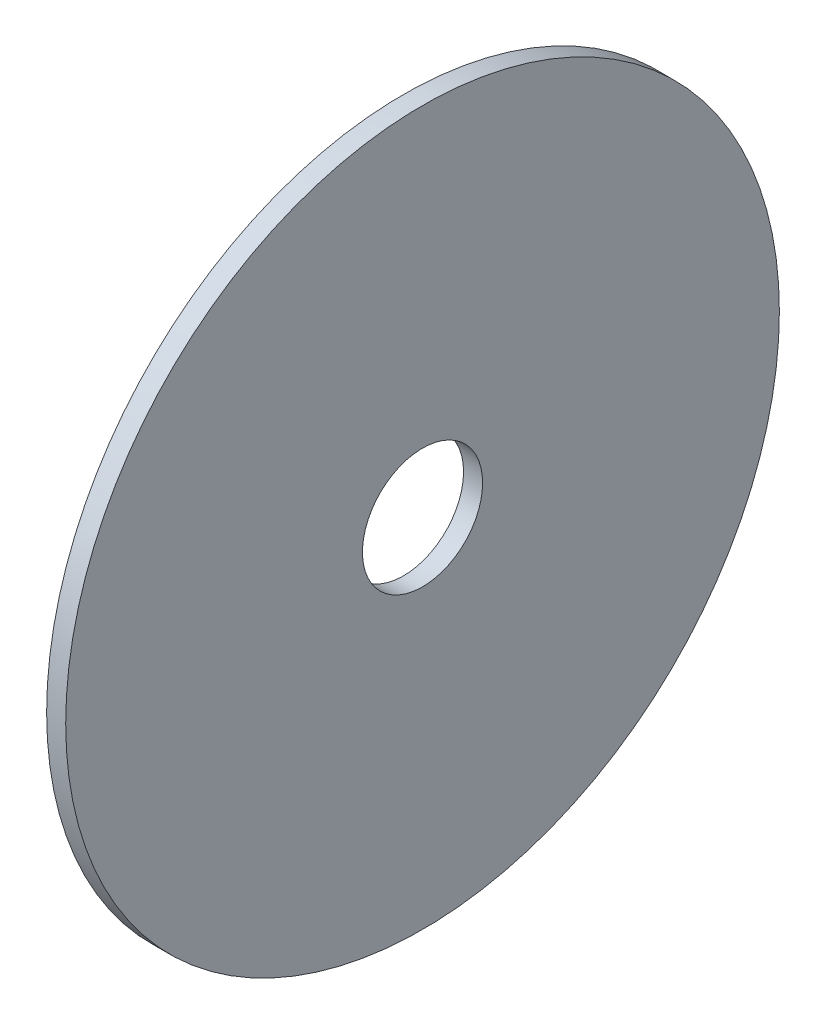
ISO-10303-21;
HEADER;
FILE_DESCRIPTION(('STEP AP214'),'2;1');
FILE_NAME('part.step','',(''),(''),'','','');
FILE_SCHEMA(('AUTOMOTIVE_DESIGN { 1 0 10303 214 1 1 1 1 }'));
ENDSEC;
DATA;
#1=APPLICATION_CONTEXT('core data for automotive mechanical design processes');
#2=APPLICATION_PROTOCOL_DEFINITION('international standard','automotive_design',2000,#1);
#3=PRODUCT_CONTEXT('',#1,'mechanical');
#4=PRODUCT('Part','Part','',(#3));
#5=PRODUCT_RELATED_PRODUCT_CATEGORY('part','',(#4));
#6=PRODUCT_DEFINITION_FORMATION('','',#4);
#7=PRODUCT_DEFINITION_CONTEXT('part definition',#1,'design');
#8=PRODUCT_DEFINITION('design','',#6,#7);
#9=PRODUCT_DEFINITION_SHAPE('','',#8);
#10=(LENGTH_UNIT() NAMED_UNIT(*) SI_UNIT(.MILLI.,.METRE.));
#11=(NAMED_UNIT(*) PLANE_ANGLE_UNIT() SI_UNIT($,.RADIAN.));
#12=(NAMED_UNIT(*) SI_UNIT($,.STERADIAN.) SOLID_ANGLE_UNIT());
#13=UNCERTAINTY_MEASURE_WITH_UNIT(LENGTH_MEASURE(1.E-05),#10,'distance_accuracy_value','');
#14=(GEOMETRIC_REPRESENTATION_CONTEXT(3) GLOBAL_UNCERTAINTY_ASSIGNED_CONTEXT((#13)) GLOBAL_UNIT_ASSIGNED_CONTEXT((#10,
#11,#12)) REPRESENTATION_CONTEXT('',''));
#15=CARTESIAN_POINT('',(0.,0.,0.));
#16=DIRECTION('',(0.,0.,1.));
#17=DIRECTION('',(1.,0.,0.));
#18=AXIS2_PLACEMENT_3D('',#15,#16,#17);
#19=CARTESIAN_POINT('',(21.,1.38777878078145E-13,-1.66533453693773E-13));
#20=DIRECTION('',(1.,0.,0.));
#21=DIRECTION('',(0.,0.,-1.));
#22=AXIS2_PLACEMENT_3D('',#19,#20,#21);
#23=CYLINDRICAL_SURFACE('',#22,74.85);
#24=CARTESIAN_POINT('',(21.,1.38777878078145E-13,-1.66533453693773E-13));
#25=DIRECTION('',(1.,0.,0.));
#26=DIRECTION('',(0.,0.,-1.));
#27=AXIS2_PLACEMENT_3D('',#24,#25,#26);
#28=CIRCLE('',#27,74.85);
#29=CARTESIAN_POINT('',(21.,1.34622868408485E-13,-74.8500000000004));
#30=VERTEX_POINT('',#29);
#31=EDGE_CURVE('E10',#30,#30,#28,.T.);
#32=ORIENTED_EDGE('',*,*,#31,.T.);
#33=EDGE_LOOP('',(#32));
#34=FACE_BOUND('',#33,.T.);
#35=CARTESIAN_POINT('',(25.,1.38777878078145E-13,-1.66533453693773E-13));
#36=DIRECTION('',(1.,0.,0.));
#37=DIRECTION('',(0.,0.,-1.));
#38=AXIS2_PLACEMENT_3D('',#35,#36,#37);
#39=CIRCLE('',#38,74.85);
#40=CARTESIAN_POINT('',(25.,1.34622868408485E-13,-74.8500000000004));
#41=VERTEX_POINT('',#40);
#42=EDGE_CURVE('E37',#41,#41,#39,.T.);
#43=ORIENTED_EDGE('',*,*,#42,.F.);
#44=EDGE_LOOP('',(#43));
#45=FACE_BOUND('',#44,.T.);
#46=ADVANCED_FACE('F34',(#34,#45),#23,.T.);
#47=CARTESIAN_POINT('',(21.,1.38777878078145E-13,-1.66533453693773E-13));
#48=DIRECTION('',(1.,0.,0.));
#49=DIRECTION('',(0.,0.,-1.));
#50=AXIS2_PLACEMENT_3D('',#47,#48,#49);
#51=PLANE('',#50);
#52=CARTESIAN_POINT('',(21.,1.38777878078145E-13,-1.66533453693773E-13));
#53=DIRECTION('',(1.,0.,0.));
#54=DIRECTION('',(0.,0.,-1.));
#55=AXIS2_PLACEMENT_3D('',#52,#53,#54);
#56=CIRCLE('',#55,12.6);
#57=CARTESIAN_POINT('',(21.,1.38078437572631E-13,-12.6000000000002));
#58=VERTEX_POINT('',#57);
#59=EDGE_CURVE('E44',#58,#58,#56,.T.);
#60=ORIENTED_EDGE('',*,*,#59,.T.);
#61=EDGE_LOOP('',(#60));
#62=FACE_BOUND('',#61,.T.);
#63=ORIENTED_EDGE('',*,*,#31,.F.);
#64=EDGE_LOOP('',(#63));
#65=FACE_BOUND('',#64,.T.);
#66=ADVANCED_FACE('F52',(#62,#65),#51,.F.);
#67=CARTESIAN_POINT('',(25.,1.38777878078145E-13,-1.66533453693773E-13));
#68=DIRECTION('',(1.,0.,0.));
#69=DIRECTION('',(0.,0.,-1.));
#70=AXIS2_PLACEMENT_3D('',#67,#68,#69);
#71=PLANE('',#70);
#72=CARTESIAN_POINT('',(25.,1.38777878078145E-13,-1.66533453693773E-13));
#73=DIRECTION('',(1.,0.,0.));
#74=DIRECTION('',(0.,0.,-1.));
#75=AXIS2_PLACEMENT_3D('',#72,#73,#74);
#76=CIRCLE('',#75,12.6);
#77=CARTESIAN_POINT('',(25.,1.38078437572631E-13,-12.6000000000002));
#78=VERTEX_POINT('',#77);
#79=EDGE_CURVE('E46',#78,#78,#76,.T.);
#80=ORIENTED_EDGE('',*,*,#79,.F.);
#81=EDGE_LOOP('',(#80));
#82=FACE_BOUND('',#81,.T.);
#83=ORIENTED_EDGE('',*,*,#42,.T.);
#84=EDGE_LOOP('',(#83));
#85=FACE_BOUND('',#84,.T.);
#86=ADVANCED_FACE('F58',(#82,#85),#71,.T.);
#87=CARTESIAN_POINT('',(21.,1.38777878078145E-13,-1.66533453693773E-13));
#88=DIRECTION('',(1.,0.,0.));
#89=DIRECTION('',(0.,0.,-1.));
#90=AXIS2_PLACEMENT_3D('',#87,#88,#89);
#91=CYLINDRICAL_SURFACE('',#90,12.6);
#92=ORIENTED_EDGE('',*,*,#59,.F.);
#93=EDGE_LOOP('',(#92));
#94=FACE_BOUND('',#93,.T.);
#95=ORIENTED_EDGE('',*,*,#79,.T.);
#96=EDGE_LOOP('',(#95));
#97=FACE_BOUND('',#96,.T.);
#98=ADVANCED_FACE('F55',(#94,#97),#91,.F.);
#99=CLOSED_SHELL('',(#46,#66,#86,#98));
#100=MANIFOLD_SOLID_BREP('B2',#99);
#101=ADVANCED_BREP_SHAPE_REPRESENTATION('',(#18,#100),#14);
#102=SHAPE_DEFINITION_REPRESENTATION(#9,#101);
ENDSEC;
END-ISO-10303-21;
